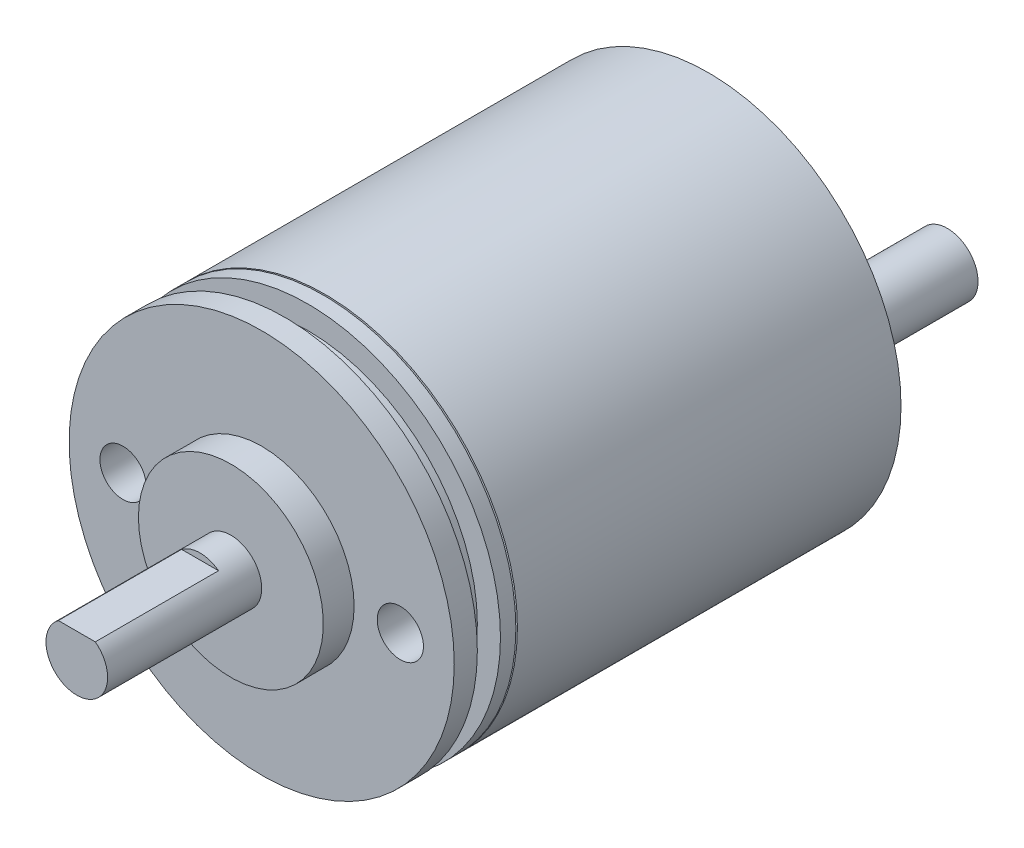
ISO-10303-21;
HEADER;
FILE_DESCRIPTION(('STEP AP214'),'2;1');
FILE_NAME('part.step','',(''),(''),'','','');
FILE_SCHEMA(('AUTOMOTIVE_DESIGN { 1 0 10303 214 1 1 1 1 }'));
ENDSEC;
DATA;
#1=APPLICATION_CONTEXT('core data for automotive mechanical design processes');
#2=APPLICATION_PROTOCOL_DEFINITION('international standard','automotive_design',2000,#1);
#3=PRODUCT_CONTEXT('',#1,'mechanical');
#4=PRODUCT('Part','Part','',(#3));
#5=PRODUCT_RELATED_PRODUCT_CATEGORY('part','',(#4));
#6=PRODUCT_DEFINITION_FORMATION('','',#4);
#7=PRODUCT_DEFINITION_CONTEXT('part definition',#1,'design');
#8=PRODUCT_DEFINITION('design','',#6,#7);
#9=PRODUCT_DEFINITION_SHAPE('','',#8);
#10=(LENGTH_UNIT() NAMED_UNIT(*) SI_UNIT(.MILLI.,.METRE.));
#11=(NAMED_UNIT(*) PLANE_ANGLE_UNIT() SI_UNIT($,.RADIAN.));
#12=(NAMED_UNIT(*) SI_UNIT($,.STERADIAN.) SOLID_ANGLE_UNIT());
#13=UNCERTAINTY_MEASURE_WITH_UNIT(LENGTH_MEASURE(1.E-05),#10,'distance_accuracy_value','');
#14=(GEOMETRIC_REPRESENTATION_CONTEXT(3) GLOBAL_UNCERTAINTY_ASSIGNED_CONTEXT((#13)) GLOBAL_UNIT_ASSIGNED_CONTEXT((#10,
#11,#12)) REPRESENTATION_CONTEXT('',''));
#15=CARTESIAN_POINT('',(0.,0.,0.));
#16=DIRECTION('',(0.,0.,1.));
#17=DIRECTION('',(1.,0.,0.));
#18=AXIS2_PLACEMENT_3D('',#15,#16,#17);
#19=CARTESIAN_POINT('',(-9.,0.,-29.));
#20=DIRECTION('',(0.,0.,1.));
#21=DIRECTION('',(1.,0.,0.));
#22=AXIS2_PLACEMENT_3D('',#19,#20,#21);
#23=CYLINDRICAL_SURFACE('',#22,12.5);
#24=CARTESIAN_POINT('',(-9.,0.,-4.));
#25=DIRECTION('',(0.,0.,1.));
#26=DIRECTION('',(1.,0.,0.));
#27=AXIS2_PLACEMENT_3D('',#24,#25,#26);
#28=CIRCLE('',#27,12.5);
#29=CARTESIAN_POINT('',(3.5,0.,-4.));
#30=VERTEX_POINT('',#29);
#31=EDGE_CURVE('E128',#30,#30,#28,.T.);
#32=ORIENTED_EDGE('',*,*,#31,.T.);
#33=EDGE_LOOP('',(#32));
#34=FACE_BOUND('',#33,.T.);
#35=CARTESIAN_POINT('',(-9.,0.,-3.));
#36=DIRECTION('',(0.,0.,1.));
#37=DIRECTION('',(1.,0.,0.));
#38=AXIS2_PLACEMENT_3D('',#35,#36,#37);
#39=CIRCLE('',#38,12.5);
#40=CARTESIAN_POINT('',(3.5,0.,-3.));
#41=VERTEX_POINT('',#40);
#42=EDGE_CURVE('E131',#41,#41,#39,.T.);
#43=ORIENTED_EDGE('',*,*,#42,.F.);
#44=EDGE_LOOP('',(#43));
#45=FACE_BOUND('',#44,.T.);
#46=ADVANCED_FACE('F16',(#34,#45),#23,.T.);
#47=CARTESIAN_POINT('',(-9.,0.,-3.));
#48=DIRECTION('',(0.,0.,1.));
#49=DIRECTION('',(1.,0.,0.));
#50=AXIS2_PLACEMENT_3D('',#47,#48,#49);
#51=PLANE('',#50);
#52=CARTESIAN_POINT('',(-9.,0.,-3.));
#53=DIRECTION('',(0.,0.,1.));
#54=DIRECTION('',(1.,0.,0.));
#55=AXIS2_PLACEMENT_3D('',#52,#53,#54);
#56=CIRCLE('',#55,11.);
#57=CARTESIAN_POINT('',(2.,0.,-3.));
#58=VERTEX_POINT('',#57);
#59=EDGE_CURVE('E141',#58,#58,#56,.T.);
#60=ORIENTED_EDGE('',*,*,#59,.F.);
#61=EDGE_LOOP('',(#60));
#62=FACE_BOUND('',#61,.T.);
#63=ORIENTED_EDGE('',*,*,#42,.T.);
#64=EDGE_LOOP('',(#63));
#65=FACE_BOUND('',#64,.T.);
#66=ADVANCED_FACE('F117',(#62,#65),#51,.T.);
#67=CARTESIAN_POINT('',(-9.,0.,-1.5));
#68=DIRECTION('',(0.,0.,1.));
#69=DIRECTION('',(1.,0.,0.));
#70=AXIS2_PLACEMENT_3D('',#67,#68,#69);
#71=PLANE('',#70);
#72=CARTESIAN_POINT('',(-9.,0.,-1.5));
#73=DIRECTION('',(0.,0.,1.));
#74=DIRECTION('',(1.,0.,0.));
#75=AXIS2_PLACEMENT_3D('',#72,#73,#74);
#76=CIRCLE('',#75,11.);
#77=CARTESIAN_POINT('',(2.,0.,-1.5));
#78=VERTEX_POINT('',#77);
#79=EDGE_CURVE('E221',#78,#78,#76,.T.);
#80=ORIENTED_EDGE('',*,*,#79,.T.);
#81=EDGE_LOOP('',(#80));
#82=FACE_BOUND('',#81,.T.);
#83=CARTESIAN_POINT('',(-9.,0.,-1.5));
#84=DIRECTION('',(0.,0.,1.));
#85=DIRECTION('',(1.,0.,0.));
#86=AXIS2_PLACEMENT_3D('',#83,#84,#85);
#87=CIRCLE('',#86,12.5);
#88=CARTESIAN_POINT('',(3.5,0.,-1.5));
#89=VERTEX_POINT('',#88);
#90=EDGE_CURVE('E135',#89,#89,#87,.T.);
#91=ORIENTED_EDGE('',*,*,#90,.F.);
#92=EDGE_LOOP('',(#91));
#93=FACE_BOUND('',#92,.T.);
#94=ADVANCED_FACE('F122',(#82,#93),#71,.F.);
#95=CARTESIAN_POINT('',(-9.,0.,-3.));
#96=DIRECTION('',(0.,0.,1.));
#97=DIRECTION('',(1.,0.,0.));
#98=AXIS2_PLACEMENT_3D('',#95,#96,#97);
#99=CYLINDRICAL_SURFACE('',#98,11.);
#100=ORIENTED_EDGE('',*,*,#59,.T.);
#101=EDGE_LOOP('',(#100));
#102=FACE_BOUND('',#101,.T.);
#103=ORIENTED_EDGE('',*,*,#79,.F.);
#104=EDGE_LOOP('',(#103));
#105=FACE_BOUND('',#104,.T.);
#106=ADVANCED_FACE('F171',(#102,#105),#99,.T.);
#107=CARTESIAN_POINT('',(-11.,0.,12.));
#108=DIRECTION('',(0.,0.,1.));
#109=DIRECTION('',(1.,0.,0.));
#110=AXIS2_PLACEMENT_3D('',#107,#108,#109);
#111=PLANE('',#110);
#112=DIRECTION('',(1.,0.,0.));
#113=VECTOR('',#112,1.);
#114=CARTESIAN_POINT('',(-10.2,1.6,12.));
#115=LINE('',#114,#113);
#116=CARTESIAN_POINT('',(-10.2,1.6,12.));
#117=VERTEX_POINT('',#116);
#118=CARTESIAN_POINT('',(-7.8,1.6,12.));
#119=VERTEX_POINT('',#118);
#120=EDGE_CURVE('E46',#117,#119,#115,.T.);
#121=ORIENTED_EDGE('',*,*,#120,.F.);
#122=CARTESIAN_POINT('',(-9.,0.,12.));
#123=DIRECTION('',(0.,0.,-1.));
#124=DIRECTION('',(-1.,0.,0.));
#125=AXIS2_PLACEMENT_3D('',#122,#123,#124);
#126=CIRCLE('',#125,2.);
#127=EDGE_CURVE('E56',#119,#117,#126,.T.);
#128=ORIENTED_EDGE('',*,*,#127,.F.);
#129=EDGE_LOOP('',(#121,#128));
#130=FACE_BOUND('',#129,.T.);
#131=ADVANCED_FACE('F55',(#130),#111,.T.);
#132=CARTESIAN_POINT('',(-9.,0.,-16.4289118373157));
#133=DIRECTION('',(0.,0.,-1.));
#134=DIRECTION('',(-1.,0.,0.));
#135=AXIS2_PLACEMENT_3D('',#132,#133,#134);
#136=CYLINDRICAL_SURFACE('',#135,2.);
#137=DIRECTION('',(0.,0.,1.));
#138=VECTOR('',#137,1.);
#139=CARTESIAN_POINT('',(-10.2,1.6,4.));
#140=LINE('',#139,#138);
#141=CARTESIAN_POINT('',(-10.2,1.6,4.));
#142=VERTEX_POINT('',#141);
#143=EDGE_CURVE('E43',#142,#117,#140,.T.);
#144=ORIENTED_EDGE('',*,*,#143,.F.);
#145=CARTESIAN_POINT('',(-9.,0.,4.));
#146=DIRECTION('',(0.,0.,1.));
#147=DIRECTION('',(1.,0.,0.));
#148=AXIS2_PLACEMENT_3D('',#145,#146,#147);
#149=CIRCLE('',#148,2.);
#150=CARTESIAN_POINT('',(-7.8,1.6,4.));
#151=VERTEX_POINT('',#150);
#152=EDGE_CURVE('E35',#151,#142,#149,.T.);
#153=ORIENTED_EDGE('',*,*,#152,.F.);
#154=DIRECTION('',(0.,0.,1.));
#155=VECTOR('',#154,1.);
#156=CARTESIAN_POINT('',(-7.8,1.6,4.));
#157=LINE('',#156,#155);
#158=EDGE_CURVE('E51',#151,#119,#157,.T.);
#159=ORIENTED_EDGE('',*,*,#158,.T.);
#160=ORIENTED_EDGE('',*,*,#127,.T.);
#161=EDGE_LOOP('',(#144,#153,#159,#160));
#162=FACE_BOUND('',#161,.T.);
#163=CARTESIAN_POINT('',(-9.,0.,2.));
#164=DIRECTION('',(0.,0.,-1.));
#165=DIRECTION('',(-1.,0.,0.));
#166=AXIS2_PLACEMENT_3D('',#163,#164,#165);
#167=CIRCLE('',#166,2.);
#168=CARTESIAN_POINT('',(-11.,0.,2.));
#169=VERTEX_POINT('',#168);
#170=EDGE_CURVE('E63',#169,#169,#167,.T.);
#171=ORIENTED_EDGE('',*,*,#170,.F.);
#172=EDGE_LOOP('',(#171));
#173=FACE_BOUND('',#172,.T.);
#174=ADVANCED_FACE('F60',(#162,#173),#136,.T.);
#175=CARTESIAN_POINT('',(-15.,0.,2.));
#176=DIRECTION('',(0.,0.,1.));
#177=DIRECTION('',(1.,0.,0.));
#178=AXIS2_PLACEMENT_3D('',#175,#176,#177);
#179=PLANE('',#178);
#180=ORIENTED_EDGE('',*,*,#170,.T.);
#181=EDGE_LOOP('',(#180));
#182=FACE_BOUND('',#181,.T.);
#183=CARTESIAN_POINT('',(-9.,0.,2.));
#184=DIRECTION('',(0.,0.,-1.));
#185=DIRECTION('',(-1.,0.,0.));
#186=AXIS2_PLACEMENT_3D('',#183,#184,#185);
#187=CIRCLE('',#186,6.);
#188=CARTESIAN_POINT('',(-15.,0.,2.));
#189=VERTEX_POINT('',#188);
#190=EDGE_CURVE('E70',#189,#189,#187,.T.);
#191=ORIENTED_EDGE('',*,*,#190,.F.);
#192=EDGE_LOOP('',(#191));
#193=FACE_BOUND('',#192,.T.);
#194=ADVANCED_FACE('F174',(#182,#193),#179,.T.);
#195=CARTESIAN_POINT('',(-9.,0.,-16.4289118373157));
#196=DIRECTION('',(0.,0.,-1.));
#197=DIRECTION('',(-1.,0.,0.));
#198=AXIS2_PLACEMENT_3D('',#195,#196,#197);
#199=CYLINDRICAL_SURFACE('',#198,6.);
#200=ORIENTED_EDGE('',*,*,#190,.T.);
#201=EDGE_LOOP('',(#200));
#202=FACE_BOUND('',#201,.T.);
#203=CARTESIAN_POINT('',(-9.,0.,0.));
#204=DIRECTION('',(0.,0.,1.));
#205=DIRECTION('',(1.,0.,0.));
#206=AXIS2_PLACEMENT_3D('',#203,#204,#205);
#207=CIRCLE('',#206,6.);
#208=CARTESIAN_POINT('',(-3.,0.,0.));
#209=VERTEX_POINT('',#208);
#210=EDGE_CURVE('E25',#209,#209,#207,.T.);
#211=ORIENTED_EDGE('',*,*,#210,.T.);
#212=EDGE_LOOP('',(#211));
#213=FACE_BOUND('',#212,.T.);
#214=ADVANCED_FACE('F91',(#202,#213),#199,.T.);
#215=CARTESIAN_POINT('',(-9.,0.,0.));
#216=DIRECTION('',(0.,0.,1.));
#217=DIRECTION('',(1.,0.,0.));
#218=AXIS2_PLACEMENT_3D('',#215,#216,#217);
#219=PLANE('',#218);
#220=CARTESIAN_POINT('',(-18.,0.,0.));
#221=DIRECTION('',(0.,0.,1.));
#222=DIRECTION('',(1.,0.,0.));
#223=AXIS2_PLACEMENT_3D('',#220,#221,#222);
#224=CIRCLE('',#223,1.5);
#225=CARTESIAN_POINT('',(-16.5,0.,0.));
#226=VERTEX_POINT('',#225);
#227=EDGE_CURVE('E204',#226,#226,#224,.T.);
#228=ORIENTED_EDGE('',*,*,#227,.F.);
#229=EDGE_LOOP('',(#228));
#230=FACE_BOUND('',#229,.T.);
#231=CARTESIAN_POINT('',(0.,0.,0.));
#232=DIRECTION('',(0.,0.,1.));
#233=DIRECTION('',(1.,0.,0.));
#234=AXIS2_PLACEMENT_3D('',#231,#232,#233);
#235=CIRCLE('',#234,1.5);
#236=CARTESIAN_POINT('',(1.5,0.,0.));
#237=VERTEX_POINT('',#236);
#238=EDGE_CURVE('E213',#237,#237,#235,.T.);
#239=ORIENTED_EDGE('',*,*,#238,.F.);
#240=EDGE_LOOP('',(#239));
#241=FACE_BOUND('',#240,.T.);
#242=ORIENTED_EDGE('',*,*,#210,.F.);
#243=EDGE_LOOP('',(#242));
#244=FACE_BOUND('',#243,.T.);
#245=CARTESIAN_POINT('',(-9.,0.,0.));
#246=DIRECTION('',(0.,0.,1.));
#247=DIRECTION('',(1.,0.,0.));
#248=AXIS2_PLACEMENT_3D('',#245,#246,#247);
#249=CIRCLE('',#248,12.5);
#250=CARTESIAN_POINT('',(3.5,0.,0.));
#251=VERTEX_POINT('',#250);
#252=EDGE_CURVE('E80',#251,#251,#249,.T.);
#253=ORIENTED_EDGE('',*,*,#252,.T.);
#254=EDGE_LOOP('',(#253));
#255=FACE_BOUND('',#254,.T.);
#256=ADVANCED_FACE('F93',(#230,#241,#244,#255),#219,.T.);
#257=ORIENTED_EDGE('',*,*,#90,.T.);
#258=EDGE_LOOP('',(#257));
#259=FACE_BOUND('',#258,.T.);
#260=ORIENTED_EDGE('',*,*,#252,.F.);
#261=EDGE_LOOP('',(#260));
#262=FACE_BOUND('',#261,.T.);
#263=ADVANCED_FACE('F18',(#259,#262),#23,.T.);
#264=CARTESIAN_POINT('',(0.,0.,-4.));
#265=DIRECTION('',(0.,0.,1.));
#266=DIRECTION('',(1.,0.,0.));
#267=AXIS2_PLACEMENT_3D('',#264,#265,#266);
#268=CYLINDRICAL_SURFACE('',#267,1.5);
#269=CARTESIAN_POINT('',(0.,0.,-4.));
#270=DIRECTION('',(0.,0.,1.));
#271=DIRECTION('',(1.,0.,0.));
#272=AXIS2_PLACEMENT_3D('',#269,#270,#271);
#273=CIRCLE('',#272,1.5);
#274=CARTESIAN_POINT('',(1.5,0.,-4.));
#275=VERTEX_POINT('',#274);
#276=EDGE_CURVE('E217',#275,#275,#273,.T.);
#277=ORIENTED_EDGE('',*,*,#276,.F.);
#278=EDGE_LOOP('',(#277));
#279=FACE_BOUND('',#278,.T.);
#280=ORIENTED_EDGE('',*,*,#238,.T.);
#281=EDGE_LOOP('',(#280));
#282=FACE_BOUND('',#281,.T.);
#283=ADVANCED_FACE('F101',(#279,#282),#268,.F.);
#284=CARTESIAN_POINT('',(0.,0.,-4.));
#285=DIRECTION('',(0.,0.,1.));
#286=DIRECTION('',(1.,0.,0.));
#287=AXIS2_PLACEMENT_3D('',#284,#285,#286);
#288=PLANE('',#287);
#289=ORIENTED_EDGE('',*,*,#276,.T.);
#290=EDGE_LOOP('',(#289));
#291=FACE_BOUND('',#290,.T.);
#292=ADVANCED_FACE('F109',(#291),#288,.T.);
#293=CARTESIAN_POINT('',(-18.,0.,-4.));
#294=DIRECTION('',(0.,0.,1.));
#295=DIRECTION('',(1.,0.,0.));
#296=AXIS2_PLACEMENT_3D('',#293,#294,#295);
#297=CYLINDRICAL_SURFACE('',#296,1.5);
#298=CARTESIAN_POINT('',(-18.,0.,-4.));
#299=DIRECTION('',(0.,0.,1.));
#300=DIRECTION('',(1.,0.,0.));
#301=AXIS2_PLACEMENT_3D('',#298,#299,#300);
#302=CIRCLE('',#301,1.5);
#303=CARTESIAN_POINT('',(-16.5,0.,-4.));
#304=VERTEX_POINT('',#303);
#305=EDGE_CURVE('E209',#304,#304,#302,.T.);
#306=ORIENTED_EDGE('',*,*,#305,.F.);
#307=EDGE_LOOP('',(#306));
#308=FACE_BOUND('',#307,.T.);
#309=ORIENTED_EDGE('',*,*,#227,.T.);
#310=EDGE_LOOP('',(#309));
#311=FACE_BOUND('',#310,.T.);
#312=ADVANCED_FACE('F267',(#308,#311),#297,.F.);
#313=CARTESIAN_POINT('',(-18.,0.,-4.));
#314=DIRECTION('',(0.,0.,1.));
#315=DIRECTION('',(1.,0.,0.));
#316=AXIS2_PLACEMENT_3D('',#313,#314,#315);
#317=PLANE('',#316);
#318=ORIENTED_EDGE('',*,*,#305,.T.);
#319=EDGE_LOOP('',(#318));
#320=FACE_BOUND('',#319,.T.);
#321=ADVANCED_FACE('F265',(#320),#317,.T.);
#322=CARTESIAN_POINT('',(-10.2,1.6,4.));
#323=DIRECTION('',(0.,-1.,0.));
#324=DIRECTION('',(0.,0.,-1.));
#325=AXIS2_PLACEMENT_3D('',#322,#323,#324);
#326=PLANE('',#325);
#327=ORIENTED_EDGE('',*,*,#120,.T.);
#328=ORIENTED_EDGE('',*,*,#158,.F.);
#329=DIRECTION('',(1.,0.,0.));
#330=VECTOR('',#329,1.);
#331=CARTESIAN_POINT('',(-10.2,1.6,4.));
#332=LINE('',#331,#330);
#333=EDGE_CURVE('E31',#142,#151,#332,.T.);
#334=ORIENTED_EDGE('',*,*,#333,.F.);
#335=ORIENTED_EDGE('',*,*,#143,.T.);
#336=EDGE_LOOP('',(#327,#328,#334,#335));
#337=FACE_BOUND('',#336,.T.);
#338=ADVANCED_FACE('F45',(#337),#326,.F.);
#339=CARTESIAN_POINT('',(-9.,0.,4.));
#340=DIRECTION('',(0.,0.,1.));
#341=DIRECTION('',(1.,0.,0.));
#342=AXIS2_PLACEMENT_3D('',#339,#340,#341);
#343=PLANE('',#342);
#344=ORIENTED_EDGE('',*,*,#152,.T.);
#345=ORIENTED_EDGE('',*,*,#333,.T.);
#346=EDGE_LOOP('',(#344,#345));
#347=FACE_BOUND('',#346,.T.);
#348=ADVANCED_FACE('F259',(#347),#343,.T.);
#349=CARTESIAN_POINT('',(-9.,0.,-4.1));
#350=DIRECTION('',(0.,0.,1.));
#351=DIRECTION('',(1.,0.,0.));
#352=AXIS2_PLACEMENT_3D('',#349,#350,#351);
#353=PLANE('',#352);
#354=CARTESIAN_POINT('',(-9.,0.,-4.1));
#355=DIRECTION('',(0.,0.,1.));
#356=DIRECTION('',(1.,0.,0.));
#357=AXIS2_PLACEMENT_3D('',#354,#355,#356);
#358=CIRCLE('',#357,11.5);
#359=CARTESIAN_POINT('',(2.5,0.,-4.1));
#360=VERTEX_POINT('',#359);
#361=EDGE_CURVE('E195',#360,#360,#358,.T.);
#362=ORIENTED_EDGE('',*,*,#361,.F.);
#363=EDGE_LOOP('',(#362));
#364=FACE_BOUND('',#363,.T.);
#365=CARTESIAN_POINT('',(-9.,0.,-4.1));
#366=DIRECTION('',(0.,0.,1.));
#367=DIRECTION('',(1.,0.,0.));
#368=AXIS2_PLACEMENT_3D('',#365,#366,#367);
#369=CIRCLE('',#368,12.5);
#370=CARTESIAN_POINT('',(3.5,0.,-4.1));
#371=VERTEX_POINT('',#370);
#372=EDGE_CURVE('E58',#371,#371,#369,.T.);
#373=ORIENTED_EDGE('',*,*,#372,.T.);
#374=EDGE_LOOP('',(#373));
#375=FACE_BOUND('',#374,.T.);
#376=ADVANCED_FACE('F251',(#364,#375),#353,.T.);
#377=CARTESIAN_POINT('',(-9.,0.,-4.));
#378=DIRECTION('',(0.,0.,1.));
#379=DIRECTION('',(1.,0.,0.));
#380=AXIS2_PLACEMENT_3D('',#377,#378,#379);
#381=PLANE('',#380);
#382=CARTESIAN_POINT('',(-9.,0.,-4.));
#383=DIRECTION('',(0.,0.,1.));
#384=DIRECTION('',(1.,0.,0.));
#385=AXIS2_PLACEMENT_3D('',#382,#383,#384);
#386=CIRCLE('',#385,11.5);
#387=CARTESIAN_POINT('',(2.5,0.,-4.));
#388=VERTEX_POINT('',#387);
#389=EDGE_CURVE('E446',#388,#388,#386,.T.);
#390=ORIENTED_EDGE('',*,*,#389,.T.);
#391=EDGE_LOOP('',(#390));
#392=FACE_BOUND('',#391,.T.);
#393=ORIENTED_EDGE('',*,*,#31,.F.);
#394=EDGE_LOOP('',(#393));
#395=FACE_BOUND('',#394,.T.);
#396=ADVANCED_FACE('F245',(#392,#395),#381,.F.);
#397=CARTESIAN_POINT('',(-9.,0.,-4.1));
#398=DIRECTION('',(0.,0.,1.));
#399=DIRECTION('',(1.,0.,0.));
#400=AXIS2_PLACEMENT_3D('',#397,#398,#399);
#401=CYLINDRICAL_SURFACE('',#400,11.5);
#402=ORIENTED_EDGE('',*,*,#361,.T.);
#403=EDGE_LOOP('',(#402));
#404=FACE_BOUND('',#403,.T.);
#405=ORIENTED_EDGE('',*,*,#389,.F.);
#406=EDGE_LOOP('',(#405));
#407=FACE_BOUND('',#406,.T.);
#408=ADVANCED_FACE('F240',(#404,#407),#401,.T.);
#409=CARTESIAN_POINT('',(-9.,-6.,-44.5));
#410=DIRECTION('',(0.,0.,-1.));
#411=DIRECTION('',(-1.,0.,0.));
#412=AXIS2_PLACEMENT_3D('',#409,#410,#411);
#413=PLANE('',#412);
#414=CARTESIAN_POINT('',(-9.,-6.,-44.5));
#415=DIRECTION('',(0.,0.,-1.));
#416=DIRECTION('',(-1.,0.,0.));
#417=AXIS2_PLACEMENT_3D('',#414,#415,#416);
#418=CIRCLE('',#417,2.);
#419=CARTESIAN_POINT('',(-11.,-6.,-44.5));
#420=VERTEX_POINT('',#419);
#421=EDGE_CURVE('E73',#420,#420,#418,.T.);
#422=ORIENTED_EDGE('',*,*,#421,.T.);
#423=EDGE_LOOP('',(#422));
#424=FACE_BOUND('',#423,.T.);
#425=ADVANCED_FACE('F148',(#424),#413,.T.);
#426=CARTESIAN_POINT('',(-9.,-6.,-44.5));
#427=DIRECTION('',(0.,0.,1.));
#428=DIRECTION('',(1.,0.,0.));
#429=AXIS2_PLACEMENT_3D('',#426,#427,#428);
#430=CYLINDRICAL_SURFACE('',#429,2.);
#431=ORIENTED_EDGE('',*,*,#421,.F.);
#432=EDGE_LOOP('',(#431));
#433=FACE_BOUND('',#432,.T.);
#434=CARTESIAN_POINT('',(-9.,-6.,-34.5));
#435=DIRECTION('',(0.,0.,-1.));
#436=DIRECTION('',(-1.,0.,0.));
#437=AXIS2_PLACEMENT_3D('',#434,#435,#436);
#438=CIRCLE('',#437,2.);
#439=CARTESIAN_POINT('',(-11.,-6.,-34.5));
#440=VERTEX_POINT('',#439);
#441=EDGE_CURVE('E134',#440,#440,#438,.T.);
#442=ORIENTED_EDGE('',*,*,#441,.T.);
#443=EDGE_LOOP('',(#442));
#444=FACE_BOUND('',#443,.T.);
#445=ADVANCED_FACE('F150',(#433,#444),#430,.T.);
#446=CARTESIAN_POINT('',(-9.,-6.,-34.5));
#447=DIRECTION('',(0.,0.,-1.));
#448=DIRECTION('',(-1.,0.,0.));
#449=AXIS2_PLACEMENT_3D('',#446,#447,#448);
#450=PLANE('',#449);
#451=CARTESIAN_POINT('',(-9.,-6.,-34.5));
#452=DIRECTION('',(0.,0.,-1.));
#453=DIRECTION('',(-1.,0.,0.));
#454=AXIS2_PLACEMENT_3D('',#451,#452,#453);
#455=CIRCLE('',#454,3.25);
#456=CARTESIAN_POINT('',(-12.25,-6.,-34.5));
#457=VERTEX_POINT('',#456);
#458=EDGE_CURVE('E64',#457,#457,#455,.T.);
#459=ORIENTED_EDGE('',*,*,#458,.T.);
#460=EDGE_LOOP('',(#459));
#461=FACE_BOUND('',#460,.T.);
#462=ORIENTED_EDGE('',*,*,#441,.F.);
#463=EDGE_LOOP('',(#462));
#464=FACE_BOUND('',#463,.T.);
#465=ADVANCED_FACE('F153',(#461,#464),#450,.T.);
#466=CARTESIAN_POINT('',(-9.,-6.,-34.5));
#467=DIRECTION('',(0.,0.,1.));
#468=DIRECTION('',(1.,0.,0.));
#469=AXIS2_PLACEMENT_3D('',#466,#467,#468);
#470=CYLINDRICAL_SURFACE('',#469,3.25);
#471=ORIENTED_EDGE('',*,*,#458,.F.);
#472=EDGE_LOOP('',(#471));
#473=FACE_BOUND('',#472,.T.);
#474=CARTESIAN_POINT('',(-9.,-6.,-29.));
#475=DIRECTION('',(0.,0.,1.));
#476=DIRECTION('',(1.,0.,0.));
#477=AXIS2_PLACEMENT_3D('',#474,#475,#476);
#478=CIRCLE('',#477,3.25);
#479=CARTESIAN_POINT('',(-5.75,-6.,-29.));
#480=VERTEX_POINT('',#479);
#481=EDGE_CURVE('E10',#480,#480,#478,.F.);
#482=ORIENTED_EDGE('',*,*,#481,.T.);
#483=EDGE_LOOP('',(#482));
#484=FACE_BOUND('',#483,.T.);
#485=ADVANCED_FACE('F158',(#473,#484),#470,.T.);
#486=CARTESIAN_POINT('',(-9.,0.,-29.));
#487=DIRECTION('',(0.,0.,1.));
#488=DIRECTION('',(1.,0.,0.));
#489=AXIS2_PLACEMENT_3D('',#486,#487,#488);
#490=PLANE('',#489);
#491=CARTESIAN_POINT('',(-9.,0.,-29.));
#492=DIRECTION('',(0.,0.,1.));
#493=DIRECTION('',(1.,0.,0.));
#494=AXIS2_PLACEMENT_3D('',#491,#492,#493);
#495=CIRCLE('',#494,12.5);
#496=CARTESIAN_POINT('',(3.5,0.,-29.));
#497=VERTEX_POINT('',#496);
#498=EDGE_CURVE('E84',#497,#497,#495,.T.);
#499=ORIENTED_EDGE('',*,*,#498,.F.);
#500=EDGE_LOOP('',(#499));
#501=FACE_BOUND('',#500,.T.);
#502=ORIENTED_EDGE('',*,*,#481,.F.);
#503=EDGE_LOOP('',(#502));
#504=FACE_BOUND('',#503,.T.);
#505=ADVANCED_FACE('F114',(#501,#504),#490,.F.);
#506=ORIENTED_EDGE('',*,*,#498,.T.);
#507=EDGE_LOOP('',(#506));
#508=FACE_BOUND('',#507,.T.);
#509=ORIENTED_EDGE('',*,*,#372,.F.);
#510=EDGE_LOOP('',(#509));
#511=FACE_BOUND('',#510,.T.);
#512=ADVANCED_FACE('F103',(#508,#511),#23,.T.);
#513=CLOSED_SHELL('',(#46,#66,#94,#106,#131,#174,#194,#214,#256,#263,#283,#292,#312,#321,#338,
#348,#376,#396,#408,#425,#445,#465,#485,#505,#512));
#514=MANIFOLD_SOLID_BREP('B1',#513);
#515=ADVANCED_BREP_SHAPE_REPRESENTATION('',(#18,#514),#14);
#516=SHAPE_DEFINITION_REPRESENTATION(#9,#515);
ENDSEC;
END-ISO-10303-21;
